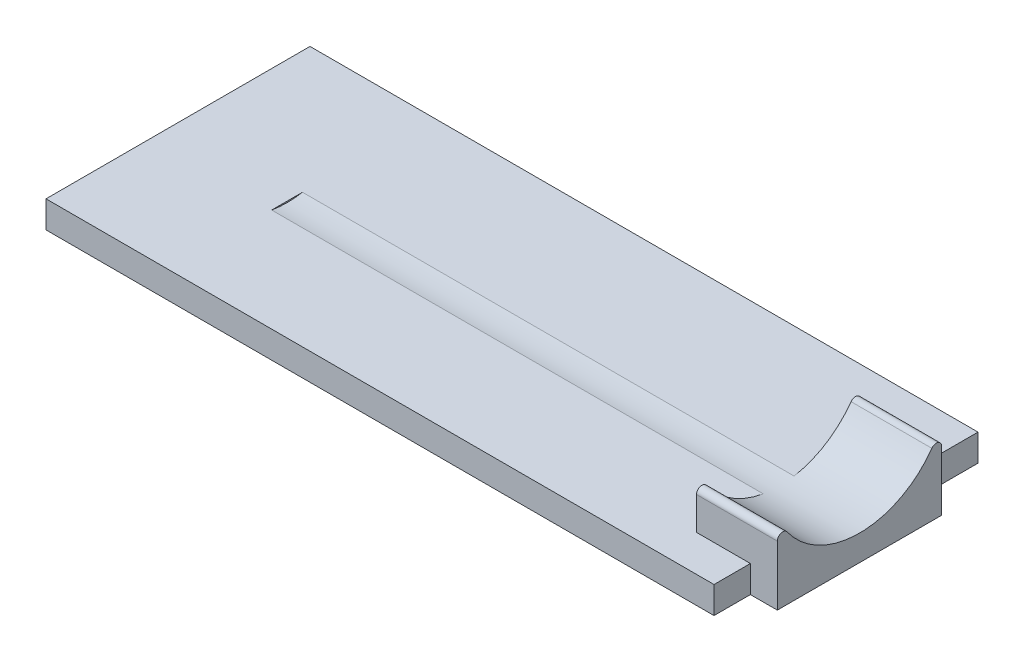
ISO-10303-21;
HEADER;
FILE_DESCRIPTION(('STEP AP214'),'2;1');
FILE_NAME('part.step','',(''),(''),'','','');
FILE_SCHEMA(('AUTOMOTIVE_DESIGN { 1 0 10303 214 1 1 1 1 }'));
ENDSEC;
DATA;
#1=APPLICATION_CONTEXT('core data for automotive mechanical design processes');
#2=APPLICATION_PROTOCOL_DEFINITION('international standard','automotive_design',2000,#1);
#3=PRODUCT_CONTEXT('',#1,'mechanical');
#4=PRODUCT('Part','Part','',(#3));
#5=PRODUCT_RELATED_PRODUCT_CATEGORY('part','',(#4));
#6=PRODUCT_DEFINITION_FORMATION('','',#4);
#7=PRODUCT_DEFINITION_CONTEXT('part definition',#1,'design');
#8=PRODUCT_DEFINITION('design','',#6,#7);
#9=PRODUCT_DEFINITION_SHAPE('','',#8);
#10=(LENGTH_UNIT() NAMED_UNIT(*) SI_UNIT(.MILLI.,.METRE.));
#11=(NAMED_UNIT(*) PLANE_ANGLE_UNIT() SI_UNIT($,.RADIAN.));
#12=(NAMED_UNIT(*) SI_UNIT($,.STERADIAN.) SOLID_ANGLE_UNIT());
#13=UNCERTAINTY_MEASURE_WITH_UNIT(LENGTH_MEASURE(1.E-05),#10,'distance_accuracy_value','');
#14=(GEOMETRIC_REPRESENTATION_CONTEXT(3) GLOBAL_UNCERTAINTY_ASSIGNED_CONTEXT((#13)) GLOBAL_UNIT_ASSIGNED_CONTEXT((#10,
#11,#12)) REPRESENTATION_CONTEXT('',''));
#15=CARTESIAN_POINT('',(0.,0.,0.));
#16=DIRECTION('',(0.,0.,1.));
#17=DIRECTION('',(1.,0.,0.));
#18=AXIS2_PLACEMENT_3D('',#15,#16,#17);
#19=CARTESIAN_POINT('',(-2.,4.25,-1.35));
#20=DIRECTION('',(1.,0.,0.));
#21=DIRECTION('',(0.,0.,-1.));
#22=AXIS2_PLACEMENT_3D('',#19,#20,#21);
#23=PLANE('',#22);
#24=DIRECTION('',(0.,-1.,0.));
#25=VECTOR('',#24,1.);
#26=CARTESIAN_POINT('',(-2.,4.25,-1.35));
#27=LINE('',#26,#25);
#28=CARTESIAN_POINT('',(-2.,2.21837503460899,-1.35));
#29=VERTEX_POINT('',#28);
#30=CARTESIAN_POINT('',(-2.,1.,-1.35));
#31=VERTEX_POINT('',#30);
#32=EDGE_CURVE('E186',#29,#31,#27,.T.);
#33=ORIENTED_EDGE('',*,*,#32,.F.);
#34=CARTESIAN_POINT('',(-2.,2.21837503460899,-1.55));
#35=DIRECTION('',(1.,0.,0.));
#36=DIRECTION('',(0.,0.,-1.));
#37=AXIS2_PLACEMENT_3D('',#34,#35,#36);
#38=CIRCLE('',#37,0.2);
#39=CARTESIAN_POINT('',(-2.,2.33446788977419,-1.71285714285715));
#40=VERTEX_POINT('',#39);
#41=EDGE_CURVE('E11',#29,#40,#38,.F.);
#42=ORIENTED_EDGE('',*,*,#41,.T.);
#43=CARTESIAN_POINT('',(-2.,4.25,-4.4));
#44=DIRECTION('',(1.,0.,0.));
#45=DIRECTION('',(0.,0.,-1.));
#46=AXIS2_PLACEMENT_3D('',#43,#44,#45);
#47=CIRCLE('',#46,3.3);
#48=CARTESIAN_POINT('',(-2.,1.,-3.82772384288702));
#49=VERTEX_POINT('',#48);
#50=EDGE_CURVE('E150',#40,#49,#47,.T.);
#51=ORIENTED_EDGE('',*,*,#50,.T.);
#52=DIRECTION('',(0.,0.,1.));
#53=VECTOR('',#52,1.);
#54=CARTESIAN_POINT('',(-2.,1.,-1.35));
#55=LINE('',#54,#53);
#56=EDGE_CURVE('E156',#49,#31,#55,.T.);
#57=ORIENTED_EDGE('',*,*,#56,.T.);
#58=EDGE_LOOP('',(#33,#42,#51,#57));
#59=FACE_BOUND('',#58,.T.);
#60=ADVANCED_FACE('F33',(#59),#23,.F.);
#61=CARTESIAN_POINT('',(0.,1.,0.));
#62=DIRECTION('',(-1.,0.,0.));
#63=DIRECTION('',(0.,0.,1.));
#64=AXIS2_PLACEMENT_3D('',#61,#62,#63);
#65=PLANE('',#64);
#66=DIRECTION('',(0.,1.,0.));
#67=VECTOR('',#66,1.);
#68=CARTESIAN_POINT('',(0.,-6.18142378421024,-1.35));
#69=LINE('',#68,#67);
#70=CARTESIAN_POINT('',(0.,0.,-1.35));
#71=VERTEX_POINT('',#70);
#72=CARTESIAN_POINT('',(0.,1.,-1.35));
#73=VERTEX_POINT('',#72);
#74=EDGE_CURVE('E163',#71,#73,#69,.T.);
#75=ORIENTED_EDGE('',*,*,#74,.T.);
#76=DIRECTION('',(0.,0.,-1.));
#77=VECTOR('',#76,1.);
#78=CARTESIAN_POINT('',(0.,1.,0.));
#79=LINE('',#78,#77);
#80=CARTESIAN_POINT('',(0.,1.,0.));
#81=VERTEX_POINT('',#80);
#82=EDGE_CURVE('E193',#81,#73,#79,.T.);
#83=ORIENTED_EDGE('',*,*,#82,.F.);
#84=DIRECTION('',(0.,-1.,0.));
#85=VECTOR('',#84,1.);
#86=CARTESIAN_POINT('',(0.,1.,0.));
#87=LINE('',#86,#85);
#88=CARTESIAN_POINT('',(0.,0.,0.));
#89=VERTEX_POINT('',#88);
#90=EDGE_CURVE('E203',#81,#89,#87,.T.);
#91=ORIENTED_EDGE('',*,*,#90,.T.);
#92=DIRECTION('',(0.,0.,-1.));
#93=VECTOR('',#92,1.);
#94=CARTESIAN_POINT('',(0.,0.,0.));
#95=LINE('',#94,#93);
#96=EDGE_CURVE('E204',#89,#71,#95,.T.);
#97=ORIENTED_EDGE('',*,*,#96,.T.);
#98=EDGE_LOOP('',(#75,#83,#91,#97));
#99=FACE_BOUND('',#98,.T.);
#100=ADVANCED_FACE('F243',(#99),#65,.F.);
#101=DIRECTION('',(0.,1.,0.));
#102=VECTOR('',#101,1.);
#103=CARTESIAN_POINT('',(0.,-6.18142378421024,-7.45));
#104=LINE('',#103,#102);
#105=CARTESIAN_POINT('',(0.,0.,-7.45));
#106=VERTEX_POINT('',#105);
#107=CARTESIAN_POINT('',(0.,1.,-7.45));
#108=VERTEX_POINT('',#107);
#109=EDGE_CURVE('E171',#106,#108,#104,.T.);
#110=ORIENTED_EDGE('',*,*,#109,.F.);
#111=CARTESIAN_POINT('',(0.,0.,-9.8));
#112=VERTEX_POINT('',#111);
#113=EDGE_CURVE('E192',#106,#112,#95,.T.);
#114=ORIENTED_EDGE('',*,*,#113,.T.);
#115=DIRECTION('',(0.,-1.,0.));
#116=VECTOR('',#115,1.);
#117=CARTESIAN_POINT('',(0.,1.,-9.8));
#118=LINE('',#117,#116);
#119=CARTESIAN_POINT('',(0.,1.,-9.8));
#120=VERTEX_POINT('',#119);
#121=EDGE_CURVE('E177',#120,#112,#118,.T.);
#122=ORIENTED_EDGE('',*,*,#121,.F.);
#123=EDGE_CURVE('E197',#108,#120,#79,.T.);
#124=ORIENTED_EDGE('',*,*,#123,.F.);
#125=EDGE_LOOP('',(#110,#114,#122,#124));
#126=FACE_BOUND('',#125,.T.);
#127=ADVANCED_FACE('F272',(#126),#65,.F.);
#128=CARTESIAN_POINT('',(0.,1.,-9.8));
#129=DIRECTION('',(0.,0.,1.));
#130=DIRECTION('',(1.,0.,0.));
#131=AXIS2_PLACEMENT_3D('',#128,#129,#130);
#132=PLANE('',#131);
#133=DIRECTION('',(-1.,0.,0.));
#134=VECTOR('',#133,1.);
#135=CARTESIAN_POINT('',(0.,0.,-9.8));
#136=LINE('',#135,#134);
#137=CARTESIAN_POINT('',(-24.8,0.,-9.8));
#138=VERTEX_POINT('',#137);
#139=EDGE_CURVE('E207',#112,#138,#136,.T.);
#140=ORIENTED_EDGE('',*,*,#139,.T.);
#141=DIRECTION('',(0.,-1.,0.));
#142=VECTOR('',#141,1.);
#143=CARTESIAN_POINT('',(-24.8,1.,-9.8));
#144=LINE('',#143,#142);
#145=CARTESIAN_POINT('',(-24.8,1.,-9.8));
#146=VERTEX_POINT('',#145);
#147=EDGE_CURVE('E218',#146,#138,#144,.T.);
#148=ORIENTED_EDGE('',*,*,#147,.F.);
#149=DIRECTION('',(-1.,0.,0.));
#150=VECTOR('',#149,1.);
#151=CARTESIAN_POINT('',(0.,1.,-9.8));
#152=LINE('',#151,#150);
#153=EDGE_CURVE('E196',#120,#146,#152,.T.);
#154=ORIENTED_EDGE('',*,*,#153,.F.);
#155=ORIENTED_EDGE('',*,*,#121,.T.);
#156=EDGE_LOOP('',(#140,#148,#154,#155));
#157=FACE_BOUND('',#156,.T.);
#158=ADVANCED_FACE('F275',(#157),#132,.F.);
#159=CARTESIAN_POINT('',(-24.8,1.,0.));
#160=DIRECTION('',(1.,0.,0.));
#161=DIRECTION('',(0.,0.,-1.));
#162=AXIS2_PLACEMENT_3D('',#159,#160,#161);
#163=PLANE('',#162);
#164=DIRECTION('',(0.,0.,1.));
#165=VECTOR('',#164,1.);
#166=CARTESIAN_POINT('',(-24.8,0.,0.));
#167=LINE('',#166,#165);
#168=CARTESIAN_POINT('',(-24.8,0.,0.));
#169=VERTEX_POINT('',#168);
#170=EDGE_CURVE('E209',#138,#169,#167,.T.);
#171=ORIENTED_EDGE('',*,*,#170,.T.);
#172=DIRECTION('',(0.,-1.,0.));
#173=VECTOR('',#172,1.);
#174=CARTESIAN_POINT('',(-24.8,1.,0.));
#175=LINE('',#174,#173);
#176=CARTESIAN_POINT('',(-24.8,1.,0.));
#177=VERTEX_POINT('',#176);
#178=EDGE_CURVE('E215',#177,#169,#175,.T.);
#179=ORIENTED_EDGE('',*,*,#178,.F.);
#180=DIRECTION('',(0.,0.,1.));
#181=VECTOR('',#180,1.);
#182=CARTESIAN_POINT('',(-24.8,1.,0.));
#183=LINE('',#182,#181);
#184=EDGE_CURVE('E199',#146,#177,#183,.T.);
#185=ORIENTED_EDGE('',*,*,#184,.F.);
#186=ORIENTED_EDGE('',*,*,#147,.T.);
#187=EDGE_LOOP('',(#171,#179,#185,#186));
#188=FACE_BOUND('',#187,.T.);
#189=ADVANCED_FACE('F281',(#188),#163,.F.);
#190=CARTESIAN_POINT('',(0.,1.,0.));
#191=DIRECTION('',(0.,0.,-1.));
#192=DIRECTION('',(-1.,0.,0.));
#193=AXIS2_PLACEMENT_3D('',#190,#191,#192);
#194=PLANE('',#193);
#195=DIRECTION('',(1.,0.,0.));
#196=VECTOR('',#195,1.);
#197=CARTESIAN_POINT('',(0.,0.,0.));
#198=LINE('',#197,#196);
#199=EDGE_CURVE('E211',#169,#89,#198,.T.);
#200=ORIENTED_EDGE('',*,*,#199,.T.);
#201=ORIENTED_EDGE('',*,*,#90,.F.);
#202=DIRECTION('',(1.,0.,0.));
#203=VECTOR('',#202,1.);
#204=CARTESIAN_POINT('',(0.,1.,0.));
#205=LINE('',#204,#203);
#206=EDGE_CURVE('E201',#177,#81,#205,.T.);
#207=ORIENTED_EDGE('',*,*,#206,.F.);
#208=ORIENTED_EDGE('',*,*,#178,.T.);
#209=EDGE_LOOP('',(#200,#201,#207,#208));
#210=FACE_BOUND('',#209,.T.);
#211=ADVANCED_FACE('F283',(#210),#194,.F.);
#212=CARTESIAN_POINT('',(0.,1.,0.));
#213=DIRECTION('',(0.,1.,0.));
#214=DIRECTION('',(0.,0.,1.));
#215=AXIS2_PLACEMENT_3D('',#212,#213,#214);
#216=PLANE('',#215);
#217=DIRECTION('',(1.,0.,0.));
#218=VECTOR('',#217,1.);
#219=CARTESIAN_POINT('',(-20.25,1.,-3.82772384288702));
#220=LINE('',#219,#218);
#221=CARTESIAN_POINT('',(-20.25,1.,-3.82772384288702));
#222=VERTEX_POINT('',#221);
#223=EDGE_CURVE('E147',#222,#49,#220,.T.);
#224=ORIENTED_EDGE('',*,*,#223,.F.);
#225=DIRECTION('',(0.,0.,-1.));
#226=VECTOR('',#225,1.);
#227=CARTESIAN_POINT('',(-20.25,1.,0.));
#228=LINE('',#227,#226);
#229=CARTESIAN_POINT('',(-20.25,1.,-4.97227615711297));
#230=VERTEX_POINT('',#229);
#231=EDGE_CURVE('E134',#222,#230,#228,.T.);
#232=ORIENTED_EDGE('',*,*,#231,.T.);
#233=DIRECTION('',(1.,0.,0.));
#234=VECTOR('',#233,1.);
#235=CARTESIAN_POINT('',(-20.25,1.,-4.97227615711297));
#236=LINE('',#235,#234);
#237=CARTESIAN_POINT('',(-2.,1.,-4.97227615711298));
#238=VERTEX_POINT('',#237);
#239=EDGE_CURVE('E149',#238,#230,#236,.F.);
#240=ORIENTED_EDGE('',*,*,#239,.F.);
#241=CARTESIAN_POINT('',(-2.,1.,-7.45));
#242=VERTEX_POINT('',#241);
#243=EDGE_CURVE('E178',#242,#238,#55,.T.);
#244=ORIENTED_EDGE('',*,*,#243,.F.);
#245=DIRECTION('',(-1.,0.,0.));
#246=VECTOR('',#245,1.);
#247=CARTESIAN_POINT('',(-2.,1.,-7.45));
#248=LINE('',#247,#246);
#249=EDGE_CURVE('E142',#108,#242,#248,.T.);
#250=ORIENTED_EDGE('',*,*,#249,.F.);
#251=ORIENTED_EDGE('',*,*,#123,.T.);
#252=ORIENTED_EDGE('',*,*,#153,.T.);
#253=ORIENTED_EDGE('',*,*,#184,.T.);
#254=ORIENTED_EDGE('',*,*,#206,.T.);
#255=ORIENTED_EDGE('',*,*,#82,.T.);
#256=DIRECTION('',(1.,0.,0.));
#257=VECTOR('',#256,1.);
#258=CARTESIAN_POINT('',(1.,1.,-1.35));
#259=LINE('',#258,#257);
#260=EDGE_CURVE('E181',#31,#73,#259,.T.);
#261=ORIENTED_EDGE('',*,*,#260,.F.);
#262=ORIENTED_EDGE('',*,*,#56,.F.);
#263=EDGE_LOOP('',(#224,#232,#240,#244,#250,#251,#252,#253,#254,#255,#261,#262));
#264=FACE_BOUND('',#263,.T.);
#265=ADVANCED_FACE('F153',(#264),#216,.T.);
#266=CARTESIAN_POINT('',(0.,0.,0.));
#267=DIRECTION('',(0.,1.,0.));
#268=DIRECTION('',(0.,0.,1.));
#269=AXIS2_PLACEMENT_3D('',#266,#267,#268);
#270=PLANE('',#269);
#271=ORIENTED_EDGE('',*,*,#96,.F.);
#272=ORIENTED_EDGE('',*,*,#199,.F.);
#273=ORIENTED_EDGE('',*,*,#170,.F.);
#274=ORIENTED_EDGE('',*,*,#139,.F.);
#275=ORIENTED_EDGE('',*,*,#113,.F.);
#276=DIRECTION('',(-1.,0.,0.));
#277=VECTOR('',#276,1.);
#278=CARTESIAN_POINT('',(0.,0.,-7.45));
#279=LINE('',#278,#277);
#280=CARTESIAN_POINT('',(0.999999999999999,0.,-7.45));
#281=VERTEX_POINT('',#280);
#282=EDGE_CURVE('E167',#281,#106,#279,.T.);
#283=ORIENTED_EDGE('',*,*,#282,.F.);
#284=DIRECTION('',(0.,0.,-1.));
#285=VECTOR('',#284,1.);
#286=CARTESIAN_POINT('',(0.999999999999999,0.,-1.35));
#287=LINE('',#286,#285);
#288=CARTESIAN_POINT('',(0.999999999999999,0.,-1.35));
#289=VERTEX_POINT('',#288);
#290=EDGE_CURVE('E164',#289,#281,#287,.T.);
#291=ORIENTED_EDGE('',*,*,#290,.F.);
#292=DIRECTION('',(1.,0.,0.));
#293=VECTOR('',#292,1.);
#294=CARTESIAN_POINT('',(0.,0.,-1.35));
#295=LINE('',#294,#293);
#296=EDGE_CURVE('E168',#71,#289,#295,.T.);
#297=ORIENTED_EDGE('',*,*,#296,.F.);
#298=EDGE_LOOP('',(#271,#272,#273,#274,#275,#283,#291,#297));
#299=FACE_BOUND('',#298,.T.);
#300=ADVANCED_FACE('F247',(#299),#270,.F.);
#301=CARTESIAN_POINT('',(0.999999999999999,4.25,-7.45));
#302=DIRECTION('',(-1.,0.,0.));
#303=DIRECTION('',(0.,0.,1.));
#304=AXIS2_PLACEMENT_3D('',#301,#302,#303);
#305=PLANE('',#304);
#306=DIRECTION('',(0.,-1.,0.));
#307=VECTOR('',#306,1.);
#308=CARTESIAN_POINT('',(0.999999999999999,4.25,-7.45));
#309=LINE('',#308,#307);
#310=CARTESIAN_POINT('',(0.999999999999999,2.218375034609,-7.45));
#311=VERTEX_POINT('',#310);
#312=EDGE_CURVE('E190',#311,#281,#309,.T.);
#313=ORIENTED_EDGE('',*,*,#312,.F.);
#314=CARTESIAN_POINT('',(1.,2.218375034609,-7.25));
#315=DIRECTION('',(-1.,0.,0.));
#316=DIRECTION('',(0.,0.,1.));
#317=AXIS2_PLACEMENT_3D('',#314,#315,#316);
#318=CIRCLE('',#317,0.2);
#319=CARTESIAN_POINT('',(0.999999999999999,2.3344678897742,-7.08714285714286));
#320=VERTEX_POINT('',#319);
#321=EDGE_CURVE('E227',#311,#320,#318,.F.);
#322=ORIENTED_EDGE('',*,*,#321,.T.);
#323=CARTESIAN_POINT('',(1.,4.25,-4.4));
#324=DIRECTION('',(1.,0.,0.));
#325=DIRECTION('',(0.,0.,-1.));
#326=AXIS2_PLACEMENT_3D('',#323,#324,#325);
#327=CIRCLE('',#326,3.3);
#328=CARTESIAN_POINT('',(1.,2.33446788977419,-1.71285714285715));
#329=VERTEX_POINT('',#328);
#330=EDGE_CURVE('E151',#329,#320,#327,.T.);
#331=ORIENTED_EDGE('',*,*,#330,.F.);
#332=CARTESIAN_POINT('',(1.,2.21837503460899,-1.55));
#333=DIRECTION('',(-1.,0.,0.));
#334=DIRECTION('',(0.,0.,1.));
#335=AXIS2_PLACEMENT_3D('',#332,#333,#334);
#336=CIRCLE('',#335,0.2);
#337=CARTESIAN_POINT('',(1.,2.21837503460899,-1.35));
#338=VERTEX_POINT('',#337);
#339=EDGE_CURVE('E225',#329,#338,#336,.F.);
#340=ORIENTED_EDGE('',*,*,#339,.T.);
#341=DIRECTION('',(0.,-1.,0.));
#342=VECTOR('',#341,1.);
#343=CARTESIAN_POINT('',(1.,4.25,-1.35));
#344=LINE('',#343,#342);
#345=EDGE_CURVE('E184',#338,#289,#344,.T.);
#346=ORIENTED_EDGE('',*,*,#345,.T.);
#347=ORIENTED_EDGE('',*,*,#290,.T.);
#348=EDGE_LOOP('',(#313,#322,#331,#340,#346,#347));
#349=FACE_BOUND('',#348,.T.);
#350=ADVANCED_FACE('F254',(#349),#305,.F.);
#351=CARTESIAN_POINT('',(-2.,4.25,-7.45));
#352=DIRECTION('',(0.,0.,1.));
#353=DIRECTION('',(1.,0.,0.));
#354=AXIS2_PLACEMENT_3D('',#351,#352,#353);
#355=PLANE('',#354);
#356=DIRECTION('',(0.,-1.,0.));
#357=VECTOR('',#356,1.);
#358=CARTESIAN_POINT('',(-2.,4.25,-7.45));
#359=LINE('',#358,#357);
#360=CARTESIAN_POINT('',(-2.,2.218375034609,-7.45));
#361=VERTEX_POINT('',#360);
#362=EDGE_CURVE('E188',#361,#242,#359,.T.);
#363=ORIENTED_EDGE('',*,*,#362,.F.);
#364=DIRECTION('',(1.,0.,0.));
#365=VECTOR('',#364,1.);
#366=CARTESIAN_POINT('',(-2.,2.218375034609,-7.45));
#367=LINE('',#366,#365);
#368=EDGE_CURVE('E141',#361,#311,#367,.T.);
#369=ORIENTED_EDGE('',*,*,#368,.T.);
#370=ORIENTED_EDGE('',*,*,#312,.T.);
#371=ORIENTED_EDGE('',*,*,#282,.T.);
#372=ORIENTED_EDGE('',*,*,#109,.T.);
#373=ORIENTED_EDGE('',*,*,#249,.T.);
#374=EDGE_LOOP('',(#363,#369,#370,#371,#372,#373));
#375=FACE_BOUND('',#374,.T.);
#376=ADVANCED_FACE('F265',(#375),#355,.F.);
#377=CARTESIAN_POINT('',(-2.,2.3344678897742,-7.08714285714286));
#378=VERTEX_POINT('',#377);
#379=EDGE_CURVE('E157',#238,#378,#47,.T.);
#380=ORIENTED_EDGE('',*,*,#379,.T.);
#381=CARTESIAN_POINT('',(-2.,2.218375034609,-7.25));
#382=DIRECTION('',(1.,0.,0.));
#383=DIRECTION('',(0.,0.,-1.));
#384=AXIS2_PLACEMENT_3D('',#381,#382,#383);
#385=CIRCLE('',#384,0.2);
#386=EDGE_CURVE('E232',#378,#361,#385,.F.);
#387=ORIENTED_EDGE('',*,*,#386,.T.);
#388=ORIENTED_EDGE('',*,*,#362,.T.);
#389=ORIENTED_EDGE('',*,*,#243,.T.);
#390=EDGE_LOOP('',(#380,#387,#388,#389));
#391=FACE_BOUND('',#390,.T.);
#392=ADVANCED_FACE('F262',(#391),#23,.F.);
#393=CARTESIAN_POINT('',(1.,4.25,-1.35));
#394=DIRECTION('',(0.,0.,-1.));
#395=DIRECTION('',(-1.,0.,0.));
#396=AXIS2_PLACEMENT_3D('',#393,#394,#395);
#397=PLANE('',#396);
#398=ORIENTED_EDGE('',*,*,#345,.F.);
#399=DIRECTION('',(1.,0.,0.));
#400=VECTOR('',#399,1.);
#401=CARTESIAN_POINT('',(1.,2.21837503460899,-1.35));
#402=LINE('',#401,#400);
#403=EDGE_CURVE('E41',#338,#29,#402,.F.);
#404=ORIENTED_EDGE('',*,*,#403,.T.);
#405=ORIENTED_EDGE('',*,*,#32,.T.);
#406=ORIENTED_EDGE('',*,*,#260,.T.);
#407=ORIENTED_EDGE('',*,*,#74,.F.);
#408=ORIENTED_EDGE('',*,*,#296,.T.);
#409=EDGE_LOOP('',(#398,#404,#405,#406,#407,#408));
#410=FACE_BOUND('',#409,.T.);
#411=ADVANCED_FACE('F236',(#410),#397,.F.);
#412=CARTESIAN_POINT('',(-20.25,4.25,-4.4));
#413=DIRECTION('',(1.,0.,0.));
#414=DIRECTION('',(0.,0.,-1.));
#415=AXIS2_PLACEMENT_3D('',#412,#413,#414);
#416=CYLINDRICAL_SURFACE('',#415,3.3);
#417=ORIENTED_EDGE('',*,*,#330,.T.);
#418=DIRECTION('',(1.,0.,0.));
#419=VECTOR('',#418,1.);
#420=CARTESIAN_POINT('',(-20.25,2.3344678897742,-7.08714285714286));
#421=LINE('',#420,#419);
#422=EDGE_CURVE('E54',#320,#378,#421,.F.);
#423=ORIENTED_EDGE('',*,*,#422,.T.);
#424=ORIENTED_EDGE('',*,*,#379,.F.);
#425=ORIENTED_EDGE('',*,*,#239,.T.);
#426=CARTESIAN_POINT('',(-20.25,4.25,-4.4));
#427=DIRECTION('',(1.,0.,0.));
#428=DIRECTION('',(0.,0.,-1.));
#429=AXIS2_PLACEMENT_3D('',#426,#427,#428);
#430=CIRCLE('',#429,3.3);
#431=EDGE_CURVE('E137',#222,#230,#430,.T.);
#432=ORIENTED_EDGE('',*,*,#431,.F.);
#433=ORIENTED_EDGE('',*,*,#223,.T.);
#434=ORIENTED_EDGE('',*,*,#50,.F.);
#435=DIRECTION('',(1.,0.,0.));
#436=VECTOR('',#435,1.);
#437=CARTESIAN_POINT('',(-20.25,2.33446788977419,-1.71285714285714));
#438=LINE('',#437,#436);
#439=EDGE_CURVE('E229',#40,#329,#438,.T.);
#440=ORIENTED_EDGE('',*,*,#439,.T.);
#441=EDGE_LOOP('',(#417,#423,#424,#425,#432,#433,#434,#440));
#442=FACE_BOUND('',#441,.T.);
#443=ADVANCED_FACE('F145',(#442),#416,.F.);
#444=CARTESIAN_POINT('',(-20.25,4.25,-4.4));
#445=DIRECTION('',(1.,0.,0.));
#446=DIRECTION('',(0.,0.,-1.));
#447=AXIS2_PLACEMENT_3D('',#444,#445,#446);
#448=PLANE('',#447);
#449=ORIENTED_EDGE('',*,*,#431,.T.);
#450=ORIENTED_EDGE('',*,*,#231,.F.);
#451=EDGE_LOOP('',(#449,#450));
#452=FACE_BOUND('',#451,.T.);
#453=ADVANCED_FACE('F136',(#452),#448,.T.);
#454=CARTESIAN_POINT('',(-20.25,2.218375034609,-7.25));
#455=DIRECTION('',(1.,0.,0.));
#456=DIRECTION('',(0.,0.,-1.));
#457=AXIS2_PLACEMENT_3D('',#454,#455,#456);
#458=CYLINDRICAL_SURFACE('',#457,0.2);
#459=ORIENTED_EDGE('',*,*,#386,.F.);
#460=ORIENTED_EDGE('',*,*,#422,.F.);
#461=ORIENTED_EDGE('',*,*,#321,.F.);
#462=ORIENTED_EDGE('',*,*,#368,.F.);
#463=EDGE_LOOP('',(#459,#460,#461,#462));
#464=FACE_BOUND('',#463,.T.);
#465=ADVANCED_FACE('F258',(#464),#458,.T.);
#466=CARTESIAN_POINT('',(-20.25,2.21837503460899,-1.55));
#467=DIRECTION('',(1.,0.,0.));
#468=DIRECTION('',(0.,0.,-1.));
#469=AXIS2_PLACEMENT_3D('',#466,#467,#468);
#470=CYLINDRICAL_SURFACE('',#469,0.2);
#471=ORIENTED_EDGE('',*,*,#339,.F.);
#472=ORIENTED_EDGE('',*,*,#439,.F.);
#473=ORIENTED_EDGE('',*,*,#41,.F.);
#474=ORIENTED_EDGE('',*,*,#403,.F.);
#475=EDGE_LOOP('',(#471,#472,#473,#474));
#476=FACE_BOUND('',#475,.T.);
#477=ADVANCED_FACE('F35',(#476),#470,.T.);
#478=CLOSED_SHELL('',(#60,#100,#127,#158,#189,#211,#265,#300,#350,#376,#392,#411,#443,#453,#465,#477));
#479=MANIFOLD_SOLID_BREP('B2',#478);
#480=ADVANCED_BREP_SHAPE_REPRESENTATION('',(#18,#479),#14);
#481=SHAPE_DEFINITION_REPRESENTATION(#9,#480);
ENDSEC;
END-ISO-10303-21;
